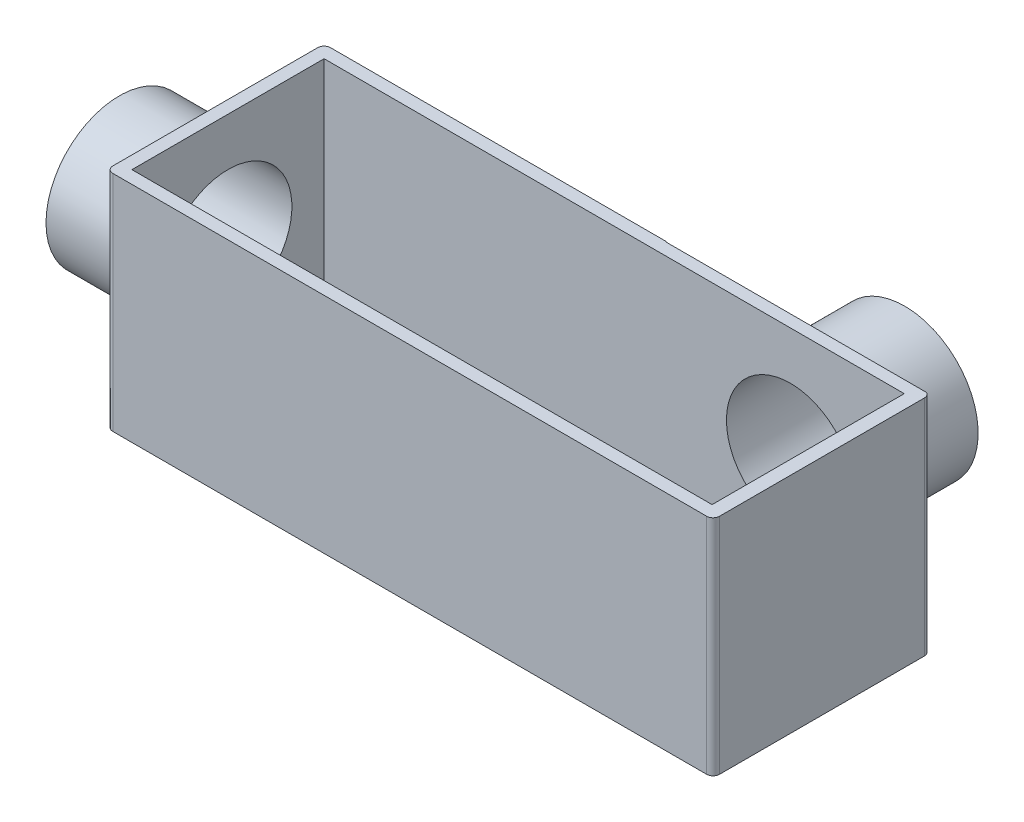
ISO-10303-21;
HEADER;
FILE_DESCRIPTION(('STEP AP214'),'2;1');
FILE_NAME('part.step','',(''),(''),'','','');
FILE_SCHEMA(('AUTOMOTIVE_DESIGN { 1 0 10303 214 1 1 1 1 }'));
ENDSEC;
DATA;
#1=APPLICATION_CONTEXT('core data for automotive mechanical design processes');
#2=APPLICATION_PROTOCOL_DEFINITION('international standard','automotive_design',2000,#1);
#3=PRODUCT_CONTEXT('',#1,'mechanical');
#4=PRODUCT('Part','Part','',(#3));
#5=PRODUCT_RELATED_PRODUCT_CATEGORY('part','',(#4));
#6=PRODUCT_DEFINITION_FORMATION('','',#4);
#7=PRODUCT_DEFINITION_CONTEXT('part definition',#1,'design');
#8=PRODUCT_DEFINITION('design','',#6,#7);
#9=PRODUCT_DEFINITION_SHAPE('','',#8);
#10=(LENGTH_UNIT() NAMED_UNIT(*) SI_UNIT(.MILLI.,.METRE.));
#11=(NAMED_UNIT(*) PLANE_ANGLE_UNIT() SI_UNIT($,.RADIAN.));
#12=(NAMED_UNIT(*) SI_UNIT($,.STERADIAN.) SOLID_ANGLE_UNIT());
#13=UNCERTAINTY_MEASURE_WITH_UNIT(LENGTH_MEASURE(1.E-05),#10,'distance_accuracy_value','');
#14=(GEOMETRIC_REPRESENTATION_CONTEXT(3) GLOBAL_UNCERTAINTY_ASSIGNED_CONTEXT((#13)) GLOBAL_UNIT_ASSIGNED_CONTEXT((#10,
#11,#12)) REPRESENTATION_CONTEXT('',''));
#15=CARTESIAN_POINT('',(0.,0.,0.));
#16=DIRECTION('',(0.,0.,1.));
#17=DIRECTION('',(1.,0.,0.));
#18=AXIS2_PLACEMENT_3D('',#15,#16,#17);
#19=CARTESIAN_POINT('',(54.,35.,-8.0909090909091));
#20=DIRECTION('',(0.,-1.,0.));
#21=DIRECTION('',(0.,0.,-1.));
#22=AXIS2_PLACEMENT_3D('',#19,#20,#21);
#23=CYLINDRICAL_SURFACE('',#22,1.);
#24=DIRECTION('',(0.,-1.,0.));
#25=VECTOR('',#24,1.);
#26=CARTESIAN_POINT('',(54.4165977904505,35.,-9.00000000000001));
#27=LINE('',#26,#25);
#28=CARTESIAN_POINT('',(54.4165977904505,35.,-9.00000000000001));
#29=VERTEX_POINT('',#28);
#30=CARTESIAN_POINT('',(54.4165977904505,0.,-9.00000000000001));
#31=VERTEX_POINT('',#30);
#32=EDGE_CURVE('E58',#29,#31,#27,.T.);
#33=ORIENTED_EDGE('',*,*,#32,.F.);
#34=CARTESIAN_POINT('',(54.,35.,-8.0909090909091));
#35=DIRECTION('',(0.,1.,0.));
#36=DIRECTION('',(0.,0.,1.));
#37=AXIS2_PLACEMENT_3D('',#34,#35,#36);
#38=CIRCLE('',#37,1.);
#39=CARTESIAN_POINT('',(55.,35.,-8.09090909090909));
#40=VERTEX_POINT('',#39);
#41=EDGE_CURVE('E213',#40,#29,#38,.T.);
#42=ORIENTED_EDGE('',*,*,#41,.F.);
#43=DIRECTION('',(0.,-1.,0.));
#44=VECTOR('',#43,1.);
#45=CARTESIAN_POINT('',(55.,35.,-8.09090909090909));
#46=LINE('',#45,#44);
#47=CARTESIAN_POINT('',(55.,0.,-8.09090909090909));
#48=VERTEX_POINT('',#47);
#49=EDGE_CURVE('E242',#40,#48,#46,.T.);
#50=ORIENTED_EDGE('',*,*,#49,.T.);
#51=CARTESIAN_POINT('',(54.,0.,-8.0909090909091));
#52=DIRECTION('',(0.,1.,0.));
#53=DIRECTION('',(0.,0.,1.));
#54=AXIS2_PLACEMENT_3D('',#51,#52,#53);
#55=CIRCLE('',#54,1.);
#56=EDGE_CURVE('E229',#48,#31,#55,.T.);
#57=ORIENTED_EDGE('',*,*,#56,.T.);
#58=EDGE_LOOP('',(#33,#42,#50,#57));
#59=FACE_BOUND('',#58,.T.);
#60=ADVANCED_FACE('F33',(#59),#23,.T.);
#61=CARTESIAN_POINT('',(-39.,35.,24.));
#62=DIRECTION('',(0.,-1.,0.));
#63=DIRECTION('',(0.,0.,-1.));
#64=AXIS2_PLACEMENT_3D('',#61,#62,#63);
#65=CYLINDRICAL_SURFACE('',#64,1.);
#66=CARTESIAN_POINT('',(-39.,0.,24.));
#67=DIRECTION('',(0.,1.,0.));
#68=DIRECTION('',(0.,0.,-1.));
#69=AXIS2_PLACEMENT_3D('',#66,#67,#68);
#70=CIRCLE('',#69,1.);
#71=CARTESIAN_POINT('',(-40.,0.,24.));
#72=VERTEX_POINT('',#71);
#73=CARTESIAN_POINT('',(-39.,0.,25.));
#74=VERTEX_POINT('',#73);
#75=EDGE_CURVE('E199',#72,#74,#70,.T.);
#76=ORIENTED_EDGE('',*,*,#75,.T.);
#77=DIRECTION('',(0.,-1.,0.));
#78=VECTOR('',#77,1.);
#79=CARTESIAN_POINT('',(-39.,35.,25.));
#80=LINE('',#79,#78);
#81=CARTESIAN_POINT('',(-39.,35.,25.));
#82=VERTEX_POINT('',#81);
#83=EDGE_CURVE('E251',#82,#74,#80,.T.);
#84=ORIENTED_EDGE('',*,*,#83,.F.);
#85=CARTESIAN_POINT('',(-39.,35.,24.));
#86=DIRECTION('',(0.,1.,0.));
#87=DIRECTION('',(0.,0.,-1.));
#88=AXIS2_PLACEMENT_3D('',#85,#86,#87);
#89=CIRCLE('',#88,1.);
#90=CARTESIAN_POINT('',(-40.,35.,24.));
#91=VERTEX_POINT('',#90);
#92=EDGE_CURVE('E204',#91,#82,#89,.T.);
#93=ORIENTED_EDGE('',*,*,#92,.F.);
#94=DIRECTION('',(0.,-1.,0.));
#95=VECTOR('',#94,1.);
#96=CARTESIAN_POINT('',(-40.,35.,24.));
#97=LINE('',#96,#95);
#98=EDGE_CURVE('E254',#91,#72,#97,.T.);
#99=ORIENTED_EDGE('',*,*,#98,.T.);
#100=EDGE_LOOP('',(#76,#84,#93,#99));
#101=FACE_BOUND('',#100,.T.);
#102=ADVANCED_FACE('F35',(#101),#65,.T.);
#103=CARTESIAN_POINT('',(54.,35.,25.));
#104=DIRECTION('',(0.,0.,-1.));
#105=DIRECTION('',(-1.,0.,0.));
#106=AXIS2_PLACEMENT_3D('',#103,#104,#105);
#107=PLANE('',#106);
#108=DIRECTION('',(1.,0.,0.));
#109=VECTOR('',#108,1.);
#110=CARTESIAN_POINT('',(54.,0.,25.));
#111=LINE('',#110,#109);
#112=CARTESIAN_POINT('',(54.,0.,25.));
#113=VERTEX_POINT('',#112);
#114=EDGE_CURVE('E223',#74,#113,#111,.T.);
#115=ORIENTED_EDGE('',*,*,#114,.T.);
#116=DIRECTION('',(0.,-1.,0.));
#117=VECTOR('',#116,1.);
#118=CARTESIAN_POINT('',(54.,35.,25.));
#119=LINE('',#118,#117);
#120=CARTESIAN_POINT('',(54.,35.,25.));
#121=VERTEX_POINT('',#120);
#122=EDGE_CURVE('E248',#121,#113,#119,.T.);
#123=ORIENTED_EDGE('',*,*,#122,.F.);
#124=DIRECTION('',(1.,0.,0.));
#125=VECTOR('',#124,1.);
#126=CARTESIAN_POINT('',(54.,35.,25.));
#127=LINE('',#126,#125);
#128=EDGE_CURVE('E207',#82,#121,#127,.T.);
#129=ORIENTED_EDGE('',*,*,#128,.F.);
#130=ORIENTED_EDGE('',*,*,#83,.T.);
#131=EDGE_LOOP('',(#115,#123,#129,#130));
#132=FACE_BOUND('',#131,.T.);
#133=ADVANCED_FACE('F297',(#132),#107,.F.);
#134=CARTESIAN_POINT('',(54.,35.,24.));
#135=DIRECTION('',(0.,-1.,0.));
#136=DIRECTION('',(0.,0.,-1.));
#137=AXIS2_PLACEMENT_3D('',#134,#135,#136);
#138=CYLINDRICAL_SURFACE('',#137,1.);
#139=CARTESIAN_POINT('',(54.,0.,24.));
#140=DIRECTION('',(0.,1.,0.));
#141=DIRECTION('',(0.,0.,1.));
#142=AXIS2_PLACEMENT_3D('',#139,#140,#141);
#143=CIRCLE('',#142,1.);
#144=CARTESIAN_POINT('',(55.,0.,24.));
#145=VERTEX_POINT('',#144);
#146=EDGE_CURVE('E225',#113,#145,#143,.T.);
#147=ORIENTED_EDGE('',*,*,#146,.T.);
#148=DIRECTION('',(0.,-1.,0.));
#149=VECTOR('',#148,1.);
#150=CARTESIAN_POINT('',(55.,35.,24.));
#151=LINE('',#150,#149);
#152=CARTESIAN_POINT('',(55.,35.,24.));
#153=VERTEX_POINT('',#152);
#154=EDGE_CURVE('E245',#153,#145,#151,.T.);
#155=ORIENTED_EDGE('',*,*,#154,.F.);
#156=CARTESIAN_POINT('',(54.,35.,24.));
#157=DIRECTION('',(0.,1.,0.));
#158=DIRECTION('',(0.,0.,1.));
#159=AXIS2_PLACEMENT_3D('',#156,#157,#158);
#160=CIRCLE('',#159,1.);
#161=EDGE_CURVE('E209',#121,#153,#160,.T.);
#162=ORIENTED_EDGE('',*,*,#161,.F.);
#163=ORIENTED_EDGE('',*,*,#122,.T.);
#164=EDGE_LOOP('',(#147,#155,#162,#163));
#165=FACE_BOUND('',#164,.T.);
#166=ADVANCED_FACE('F305',(#165),#138,.T.);
#167=CARTESIAN_POINT('',(55.,35.,24.));
#168=DIRECTION('',(-1.,0.,0.));
#169=DIRECTION('',(0.,0.,1.));
#170=AXIS2_PLACEMENT_3D('',#167,#168,#169);
#171=PLANE('',#170);
#172=DIRECTION('',(0.,0.,-1.));
#173=VECTOR('',#172,1.);
#174=CARTESIAN_POINT('',(55.,0.,24.));
#175=LINE('',#174,#173);
#176=EDGE_CURVE('E227',#145,#48,#175,.T.);
#177=ORIENTED_EDGE('',*,*,#176,.T.);
#178=ORIENTED_EDGE('',*,*,#49,.F.);
#179=DIRECTION('',(0.,0.,-1.));
#180=VECTOR('',#179,1.);
#181=CARTESIAN_POINT('',(55.,35.,24.));
#182=LINE('',#181,#180);
#183=EDGE_CURVE('E211',#153,#40,#182,.T.);
#184=ORIENTED_EDGE('',*,*,#183,.F.);
#185=ORIENTED_EDGE('',*,*,#154,.T.);
#186=EDGE_LOOP('',(#177,#178,#184,#185));
#187=FACE_BOUND('',#186,.T.);
#188=ADVANCED_FACE('F301',(#187),#171,.F.);
#189=CARTESIAN_POINT('',(-39.,35.,-9.09090909090909));
#190=DIRECTION('',(0.,0.,1.));
#191=DIRECTION('',(1.,0.,0.));
#192=AXIS2_PLACEMENT_3D('',#189,#190,#191);
#193=PLANE('',#192);
#194=DIRECTION('',(-1.,0.,0.));
#195=VECTOR('',#194,1.);
#196=CARTESIAN_POINT('',(-39.,35.,-9.09090909090909));
#197=LINE('',#196,#195);
#198=CARTESIAN_POINT('',(13.58021824893,35.,-9.0909090909091));
#199=VERTEX_POINT('',#198);
#200=CARTESIAN_POINT('',(-39.,35.,-9.09090909090909));
#201=VERTEX_POINT('',#200);
#202=EDGE_CURVE('E216',#199,#201,#197,.T.);
#203=ORIENTED_EDGE('',*,*,#202,.F.);
#204=CARTESIAN_POINT('',(35.,17.5,-9.0909090909091));
#205=DIRECTION('',(0.,0.,1.));
#206=DIRECTION('',(1.,0.,0.));
#207=AXIS2_PLACEMENT_3D('',#204,#205,#206);
#208=CIRCLE('',#207,27.6596646809659);
#209=CARTESIAN_POINT('',(13.58021824893,0.,-9.09090909090909));
#210=VERTEX_POINT('',#209);
#211=EDGE_CURVE('E189',#199,#210,#208,.T.);
#212=ORIENTED_EDGE('',*,*,#211,.T.);
#213=DIRECTION('',(-1.,0.,0.));
#214=VECTOR('',#213,1.);
#215=CARTESIAN_POINT('',(-39.,0.,-9.09090909090909));
#216=LINE('',#215,#214);
#217=CARTESIAN_POINT('',(-39.,0.,-9.09090909090909));
#218=VERTEX_POINT('',#217);
#219=EDGE_CURVE('E232',#210,#218,#216,.T.);
#220=ORIENTED_EDGE('',*,*,#219,.T.);
#221=DIRECTION('',(0.,-1.,0.));
#222=VECTOR('',#221,1.);
#223=CARTESIAN_POINT('',(-39.,35.,-9.09090909090909));
#224=LINE('',#223,#222);
#225=EDGE_CURVE('E239',#201,#218,#224,.T.);
#226=ORIENTED_EDGE('',*,*,#225,.F.);
#227=EDGE_LOOP('',(#203,#212,#220,#226));
#228=FACE_BOUND('',#227,.T.);
#229=ADVANCED_FACE('F304',(#228),#193,.F.);
#230=CARTESIAN_POINT('',(-39.,35.,-8.09090909090909));
#231=DIRECTION('',(0.,-1.,0.));
#232=DIRECTION('',(0.,0.,-1.));
#233=AXIS2_PLACEMENT_3D('',#230,#231,#232);
#234=CYLINDRICAL_SURFACE('',#233,1.);
#235=CARTESIAN_POINT('',(-39.,0.,-8.09090909090909));
#236=DIRECTION('',(0.,1.,0.));
#237=DIRECTION('',(0.,0.,1.));
#238=AXIS2_PLACEMENT_3D('',#235,#236,#237);
#239=CIRCLE('',#238,1.);
#240=CARTESIAN_POINT('',(-40.,0.,-8.09090909090908));
#241=VERTEX_POINT('',#240);
#242=EDGE_CURVE('E234',#218,#241,#239,.T.);
#243=ORIENTED_EDGE('',*,*,#242,.T.);
#244=DIRECTION('',(0.,-1.,0.));
#245=VECTOR('',#244,1.);
#246=CARTESIAN_POINT('',(-40.,35.,-8.09090909090908));
#247=LINE('',#246,#245);
#248=CARTESIAN_POINT('',(-40.,35.,-8.09090909090908));
#249=VERTEX_POINT('',#248);
#250=EDGE_CURVE('E221',#249,#241,#247,.T.);
#251=ORIENTED_EDGE('',*,*,#250,.F.);
#252=CARTESIAN_POINT('',(-39.,35.,-8.09090909090909));
#253=DIRECTION('',(0.,1.,0.));
#254=DIRECTION('',(0.,0.,1.));
#255=AXIS2_PLACEMENT_3D('',#252,#253,#254);
#256=CIRCLE('',#255,1.);
#257=EDGE_CURVE('E218',#201,#249,#256,.T.);
#258=ORIENTED_EDGE('',*,*,#257,.F.);
#259=ORIENTED_EDGE('',*,*,#225,.T.);
#260=EDGE_LOOP('',(#243,#251,#258,#259));
#261=FACE_BOUND('',#260,.T.);
#262=ADVANCED_FACE('F343',(#261),#234,.T.);
#263=CARTESIAN_POINT('',(-54.,35.,21.9545454545455));
#264=DIRECTION('',(0.,-1.,0.));
#265=DIRECTION('',(0.,0.,-1.));
#266=AXIS2_PLACEMENT_3D('',#263,#264,#265);
#267=PLANE('',#266);
#268=DIRECTION('',(1.,0.,0.));
#269=VECTOR('',#268,1.);
#270=CARTESIAN_POINT('',(52.8403353190341,35.,23.));
#271=LINE('',#270,#269);
#272=CARTESIAN_POINT('',(-38.,35.,23.));
#273=VERTEX_POINT('',#272);
#274=CARTESIAN_POINT('',(52.8403353190341,35.,23.));
#275=VERTEX_POINT('',#274);
#276=EDGE_CURVE('E167',#273,#275,#271,.T.);
#277=ORIENTED_EDGE('',*,*,#276,.F.);
#278=DIRECTION('',(0.,0.,1.));
#279=VECTOR('',#278,1.);
#280=CARTESIAN_POINT('',(-38.,35.,23.));
#281=LINE('',#280,#279);
#282=CARTESIAN_POINT('',(-38.,35.,-7.0909090909091));
#283=VERTEX_POINT('',#282);
#284=EDGE_CURVE('E50',#283,#273,#281,.T.);
#285=ORIENTED_EDGE('',*,*,#284,.F.);
#286=DIRECTION('',(-1.,0.,0.));
#287=VECTOR('',#286,1.);
#288=CARTESIAN_POINT('',(52.8403353190341,35.,-7.0909090909091));
#289=LINE('',#288,#287);
#290=CARTESIAN_POINT('',(52.8403353190341,35.,-7.0909090909091));
#291=VERTEX_POINT('',#290);
#292=EDGE_CURVE('E155',#291,#283,#289,.T.);
#293=ORIENTED_EDGE('',*,*,#292,.F.);
#294=DIRECTION('',(0.,0.,-1.));
#295=VECTOR('',#294,1.);
#296=CARTESIAN_POINT('',(52.8403353190341,35.,23.));
#297=LINE('',#296,#295);
#298=EDGE_CURVE('E158',#275,#291,#297,.T.);
#299=ORIENTED_EDGE('',*,*,#298,.F.);
#300=EDGE_LOOP('',(#277,#285,#293,#299));
#301=FACE_BOUND('',#300,.T.);
#302=DIRECTION('',(1.,0.,0.));
#303=VECTOR('',#302,1.);
#304=CARTESIAN_POINT('',(-54.,35.,-9.));
#305=LINE('',#304,#303);
#306=CARTESIAN_POINT('',(13.58021824893,35.,-9.00000000000001));
#307=VERTEX_POINT('',#306);
#308=EDGE_CURVE('E187',#307,#29,#305,.T.);
#309=ORIENTED_EDGE('',*,*,#308,.F.);
#310=DIRECTION('',(0.,0.,-1.));
#311=VECTOR('',#310,1.);
#312=CARTESIAN_POINT('',(13.58021824893,35.,-9.00000000000001));
#313=LINE('',#312,#311);
#314=EDGE_CURVE('E192',#307,#199,#313,.T.);
#315=ORIENTED_EDGE('',*,*,#314,.T.);
#316=ORIENTED_EDGE('',*,*,#202,.T.);
#317=ORIENTED_EDGE('',*,*,#257,.T.);
#318=DIRECTION('',(0.,0.,1.));
#319=VECTOR('',#318,1.);
#320=CARTESIAN_POINT('',(-40.,35.,23.9545454545455));
#321=LINE('',#320,#319);
#322=EDGE_CURVE('E202',#249,#91,#321,.T.);
#323=ORIENTED_EDGE('',*,*,#322,.T.);
#324=ORIENTED_EDGE('',*,*,#92,.T.);
#325=ORIENTED_EDGE('',*,*,#128,.T.);
#326=ORIENTED_EDGE('',*,*,#161,.T.);
#327=ORIENTED_EDGE('',*,*,#183,.T.);
#328=ORIENTED_EDGE('',*,*,#41,.T.);
#329=EDGE_LOOP('',(#309,#315,#316,#317,#323,#324,#325,#326,#327,#328));
#330=FACE_BOUND('',#329,.T.);
#331=ADVANCED_FACE('F331',(#301,#330),#267,.F.);
#332=CARTESIAN_POINT('',(-54.,0.,21.9545454545455));
#333=DIRECTION('',(0.,-1.,0.));
#334=DIRECTION('',(0.,0.,-1.));
#335=AXIS2_PLACEMENT_3D('',#332,#333,#334);
#336=PLANE('',#335);
#337=DIRECTION('',(0.,0.,-1.));
#338=VECTOR('',#337,1.);
#339=CARTESIAN_POINT('',(13.58021824893,0.,-9.00000000000001));
#340=LINE('',#339,#338);
#341=CARTESIAN_POINT('',(13.58021824893,0.,-9.00000000000001));
#342=VERTEX_POINT('',#341);
#343=EDGE_CURVE('E11',#342,#210,#340,.T.);
#344=ORIENTED_EDGE('',*,*,#343,.F.);
#345=DIRECTION('',(1.,0.,0.));
#346=VECTOR('',#345,1.);
#347=CARTESIAN_POINT('',(-54.,0.,-9.));
#348=LINE('',#347,#346);
#349=EDGE_CURVE('E42',#342,#31,#348,.T.);
#350=ORIENTED_EDGE('',*,*,#349,.T.);
#351=ORIENTED_EDGE('',*,*,#56,.F.);
#352=ORIENTED_EDGE('',*,*,#176,.F.);
#353=ORIENTED_EDGE('',*,*,#146,.F.);
#354=ORIENTED_EDGE('',*,*,#114,.F.);
#355=ORIENTED_EDGE('',*,*,#75,.F.);
#356=DIRECTION('',(0.,0.,1.));
#357=VECTOR('',#356,1.);
#358=CARTESIAN_POINT('',(-40.,0.,-8.04545454545455));
#359=LINE('',#358,#357);
#360=EDGE_CURVE('E205',#241,#72,#359,.T.);
#361=ORIENTED_EDGE('',*,*,#360,.F.);
#362=ORIENTED_EDGE('',*,*,#242,.F.);
#363=ORIENTED_EDGE('',*,*,#219,.F.);
#364=EDGE_LOOP('',(#344,#350,#351,#352,#353,#354,#355,#361,#362,#363));
#365=FACE_BOUND('',#364,.T.);
#366=ADVANCED_FACE('F324',(#365),#336,.T.);
#367=CARTESIAN_POINT('',(-40.,35.,-8.04545454545455));
#368=DIRECTION('',(1.,0.,0.));
#369=DIRECTION('',(0.,0.,-1.));
#370=AXIS2_PLACEMENT_3D('',#367,#368,#369);
#371=PLANE('',#370);
#372=ORIENTED_EDGE('',*,*,#360,.T.);
#373=ORIENTED_EDGE('',*,*,#98,.F.);
#374=ORIENTED_EDGE('',*,*,#322,.F.);
#375=ORIENTED_EDGE('',*,*,#250,.T.);
#376=EDGE_LOOP('',(#372,#373,#374,#375));
#377=FACE_BOUND('',#376,.T.);
#378=CARTESIAN_POINT('',(-40.,17.5,7.95454545454545));
#379=DIRECTION('',(-1.,0.,0.));
#380=DIRECTION('',(0.,0.,1.));
#381=AXIS2_PLACEMENT_3D('',#378,#379,#380);
#382=CIRCLE('',#381,11.5);
#383=CARTESIAN_POINT('',(-40.,17.5,19.4545454545455));
#384=VERTEX_POINT('',#383);
#385=EDGE_CURVE('E196',#384,#384,#382,.T.);
#386=ORIENTED_EDGE('',*,*,#385,.F.);
#387=EDGE_LOOP('',(#386));
#388=FACE_BOUND('',#387,.T.);
#389=ADVANCED_FACE('F338',(#377,#388),#371,.F.);
#390=CARTESIAN_POINT('',(-40.,17.5,7.95454545454545));
#391=DIRECTION('',(-1.,0.,0.));
#392=DIRECTION('',(0.,0.,1.));
#393=AXIS2_PLACEMENT_3D('',#390,#391,#392);
#394=CYLINDRICAL_SURFACE('',#393,11.5);
#395=ORIENTED_EDGE('',*,*,#385,.T.);
#396=EDGE_LOOP('',(#395));
#397=FACE_BOUND('',#396,.T.);
#398=CARTESIAN_POINT('',(-55.,17.5,7.95454545454545));
#399=DIRECTION('',(-1.,0.,0.));
#400=DIRECTION('',(0.,0.,1.));
#401=AXIS2_PLACEMENT_3D('',#398,#399,#400);
#402=CIRCLE('',#401,11.5);
#403=CARTESIAN_POINT('',(-55.,17.5,19.4545454545455));
#404=VERTEX_POINT('',#403);
#405=EDGE_CURVE('E195',#404,#404,#402,.T.);
#406=ORIENTED_EDGE('',*,*,#405,.F.);
#407=EDGE_LOOP('',(#406));
#408=FACE_BOUND('',#407,.T.);
#409=ADVANCED_FACE('F355',(#397,#408),#394,.T.);
#410=CARTESIAN_POINT('',(-55.,35.,21.9545454545454));
#411=DIRECTION('',(1.,0.,0.));
#412=DIRECTION('',(0.,0.,-1.));
#413=AXIS2_PLACEMENT_3D('',#410,#411,#412);
#414=PLANE('',#413);
#415=CARTESIAN_POINT('',(-55.,17.5,7.95454545454545));
#416=DIRECTION('',(-1.,0.,0.));
#417=DIRECTION('',(0.,0.,1.));
#418=AXIS2_PLACEMENT_3D('',#415,#416,#417);
#419=CIRCLE('',#418,10.);
#420=CARTESIAN_POINT('',(-55.,17.5,17.9545454545455));
#421=VERTEX_POINT('',#420);
#422=EDGE_CURVE('E161',#421,#421,#419,.T.);
#423=ORIENTED_EDGE('',*,*,#422,.F.);
#424=EDGE_LOOP('',(#423));
#425=FACE_BOUND('',#424,.T.);
#426=ORIENTED_EDGE('',*,*,#405,.T.);
#427=EDGE_LOOP('',(#426));
#428=FACE_BOUND('',#427,.T.);
#429=ADVANCED_FACE('F350',(#425,#428),#414,.F.);
#430=CARTESIAN_POINT('',(35.,17.5,-9.00000000000001));
#431=DIRECTION('',(0.,0.,-1.));
#432=DIRECTION('',(-1.,0.,0.));
#433=AXIS2_PLACEMENT_3D('',#430,#431,#432);
#434=CYLINDRICAL_SURFACE('',#433,27.6596646809659);
#435=CARTESIAN_POINT('',(35.,17.5,-9.00000000000001));
#436=DIRECTION('',(0.,0.,-1.));
#437=DIRECTION('',(-1.,0.,0.));
#438=AXIS2_PLACEMENT_3D('',#435,#436,#437);
#439=CIRCLE('',#438,27.6596646809659);
#440=EDGE_CURVE('E181',#342,#307,#439,.T.);
#441=ORIENTED_EDGE('',*,*,#440,.F.);
#442=ORIENTED_EDGE('',*,*,#343,.T.);
#443=ORIENTED_EDGE('',*,*,#211,.F.);
#444=ORIENTED_EDGE('',*,*,#314,.F.);
#445=EDGE_LOOP('',(#441,#442,#443,#444));
#446=FACE_BOUND('',#445,.T.);
#447=ADVANCED_FACE('F287',(#446),#434,.F.);
#448=CARTESIAN_POINT('',(35.,17.5,-9.00000000000001));
#449=DIRECTION('',(0.,0.,-1.));
#450=DIRECTION('',(-1.,0.,0.));
#451=AXIS2_PLACEMENT_3D('',#448,#449,#450);
#452=PLANE('',#451);
#453=CARTESIAN_POINT('',(35.,17.5,-9.00000000000001));
#454=DIRECTION('',(0.,0.,-1.));
#455=DIRECTION('',(-1.,0.,0.));
#456=AXIS2_PLACEMENT_3D('',#453,#454,#455);
#457=CIRCLE('',#456,11.5);
#458=CARTESIAN_POINT('',(23.5,17.5,-9.00000000000001));
#459=VERTEX_POINT('',#458);
#460=EDGE_CURVE('E178',#459,#459,#457,.T.);
#461=ORIENTED_EDGE('',*,*,#460,.F.);
#462=EDGE_LOOP('',(#461));
#463=FACE_BOUND('',#462,.T.);
#464=ORIENTED_EDGE('',*,*,#308,.T.);
#465=ORIENTED_EDGE('',*,*,#32,.T.);
#466=ORIENTED_EDGE('',*,*,#349,.F.);
#467=ORIENTED_EDGE('',*,*,#440,.T.);
#468=EDGE_LOOP('',(#464,#465,#466,#467));
#469=FACE_BOUND('',#468,.T.);
#470=ADVANCED_FACE('F281',(#463,#469),#452,.T.);
#471=CARTESIAN_POINT('',(35.,17.5,-9.00000000000001));
#472=DIRECTION('',(0.,0.,-1.));
#473=DIRECTION('',(-1.,0.,0.));
#474=AXIS2_PLACEMENT_3D('',#471,#472,#473);
#475=CYLINDRICAL_SURFACE('',#474,11.5);
#476=ORIENTED_EDGE('',*,*,#460,.T.);
#477=EDGE_LOOP('',(#476));
#478=FACE_BOUND('',#477,.T.);
#479=CARTESIAN_POINT('',(35.,17.5,-25.));
#480=DIRECTION('',(0.,0.,-1.));
#481=DIRECTION('',(-1.,0.,0.));
#482=AXIS2_PLACEMENT_3D('',#479,#480,#481);
#483=CIRCLE('',#482,11.5);
#484=CARTESIAN_POINT('',(23.5,17.5,-25.));
#485=VERTEX_POINT('',#484);
#486=EDGE_CURVE('E174',#485,#485,#483,.T.);
#487=ORIENTED_EDGE('',*,*,#486,.F.);
#488=EDGE_LOOP('',(#487));
#489=FACE_BOUND('',#488,.T.);
#490=ADVANCED_FACE('F276',(#478,#489),#475,.T.);
#491=CARTESIAN_POINT('',(21.,35.,-25.));
#492=DIRECTION('',(0.,0.,1.));
#493=DIRECTION('',(1.,0.,0.));
#494=AXIS2_PLACEMENT_3D('',#491,#492,#493);
#495=PLANE('',#494);
#496=CARTESIAN_POINT('',(35.,17.5,-25.));
#497=DIRECTION('',(0.,0.,-1.));
#498=DIRECTION('',(-1.,0.,0.));
#499=AXIS2_PLACEMENT_3D('',#496,#497,#498);
#500=CIRCLE('',#499,10.);
#501=CARTESIAN_POINT('',(25.,17.5,-25.));
#502=VERTEX_POINT('',#501);
#503=EDGE_CURVE('E264',#502,#502,#500,.T.);
#504=ORIENTED_EDGE('',*,*,#503,.F.);
#505=EDGE_LOOP('',(#504));
#506=FACE_BOUND('',#505,.T.);
#507=ORIENTED_EDGE('',*,*,#486,.T.);
#508=EDGE_LOOP('',(#507));
#509=FACE_BOUND('',#508,.T.);
#510=ADVANCED_FACE('F273',(#506,#509),#495,.F.);
#511=CARTESIAN_POINT('',(-38.,2.,23.));
#512=DIRECTION('',(-1.,0.,0.));
#513=DIRECTION('',(0.,0.,1.));
#514=AXIS2_PLACEMENT_3D('',#511,#512,#513);
#515=PLANE('',#514);
#516=CARTESIAN_POINT('',(-38.,17.5,7.95454545454545));
#517=DIRECTION('',(-1.,0.,0.));
#518=DIRECTION('',(0.,0.,1.));
#519=AXIS2_PLACEMENT_3D('',#516,#517,#518);
#520=CIRCLE('',#519,10.);
#521=CARTESIAN_POINT('',(-38.,17.5,17.9545454545454));
#522=VERTEX_POINT('',#521);
#523=EDGE_CURVE('E168',#522,#522,#520,.T.);
#524=ORIENTED_EDGE('',*,*,#523,.T.);
#525=EDGE_LOOP('',(#524));
#526=FACE_BOUND('',#525,.T.);
#527=ORIENTED_EDGE('',*,*,#284,.T.);
#528=DIRECTION('',(0.,1.,0.));
#529=VECTOR('',#528,1.);
#530=CARTESIAN_POINT('',(-38.,2.,23.));
#531=LINE('',#530,#529);
#532=CARTESIAN_POINT('',(-38.,2.,23.));
#533=VERTEX_POINT('',#532);
#534=EDGE_CURVE('E133',#533,#273,#531,.T.);
#535=ORIENTED_EDGE('',*,*,#534,.F.);
#536=DIRECTION('',(0.,0.,1.));
#537=VECTOR('',#536,1.);
#538=CARTESIAN_POINT('',(-38.,2.,23.));
#539=LINE('',#538,#537);
#540=CARTESIAN_POINT('',(-38.,2.,-7.0909090909091));
#541=VERTEX_POINT('',#540);
#542=EDGE_CURVE('E137',#541,#533,#539,.T.);
#543=ORIENTED_EDGE('',*,*,#542,.F.);
#544=DIRECTION('',(0.,1.,0.));
#545=VECTOR('',#544,1.);
#546=CARTESIAN_POINT('',(-38.,2.,-7.0909090909091));
#547=LINE('',#546,#545);
#548=EDGE_CURVE('E172',#541,#283,#547,.T.);
#549=ORIENTED_EDGE('',*,*,#548,.T.);
#550=EDGE_LOOP('',(#527,#535,#543,#549));
#551=FACE_BOUND('',#550,.T.);
#552=ADVANCED_FACE('F135',(#526,#551),#515,.F.);
#553=CARTESIAN_POINT('',(52.8403353190341,2.,-7.0909090909091));
#554=DIRECTION('',(0.,0.,-1.));
#555=DIRECTION('',(-1.,0.,0.));
#556=AXIS2_PLACEMENT_3D('',#553,#554,#555);
#557=PLANE('',#556);
#558=CARTESIAN_POINT('',(35.,17.5,-7.0909090909091));
#559=DIRECTION('',(0.,0.,-1.));
#560=DIRECTION('',(-1.,0.,0.));
#561=AXIS2_PLACEMENT_3D('',#558,#559,#560);
#562=CIRCLE('',#561,10.);
#563=CARTESIAN_POINT('',(25.,17.5,-7.0909090909091));
#564=VERTEX_POINT('',#563);
#565=EDGE_CURVE('E37',#564,#564,#562,.T.);
#566=ORIENTED_EDGE('',*,*,#565,.T.);
#567=EDGE_LOOP('',(#566));
#568=FACE_BOUND('',#567,.T.);
#569=ORIENTED_EDGE('',*,*,#292,.T.);
#570=ORIENTED_EDGE('',*,*,#548,.F.);
#571=DIRECTION('',(-1.,0.,0.));
#572=VECTOR('',#571,1.);
#573=CARTESIAN_POINT('',(52.8403353190341,2.,-7.0909090909091));
#574=LINE('',#573,#572);
#575=CARTESIAN_POINT('',(52.8403353190341,2.,-7.0909090909091));
#576=VERTEX_POINT('',#575);
#577=EDGE_CURVE('E143',#576,#541,#574,.T.);
#578=ORIENTED_EDGE('',*,*,#577,.F.);
#579=DIRECTION('',(0.,1.,0.));
#580=VECTOR('',#579,1.);
#581=CARTESIAN_POINT('',(52.8403353190341,2.,-7.0909090909091));
#582=LINE('',#581,#580);
#583=EDGE_CURVE('E175',#576,#291,#582,.T.);
#584=ORIENTED_EDGE('',*,*,#583,.T.);
#585=EDGE_LOOP('',(#569,#570,#578,#584));
#586=FACE_BOUND('',#585,.T.);
#587=ADVANCED_FACE('F415',(#568,#586),#557,.F.);
#588=CARTESIAN_POINT('',(52.8403353190341,2.,23.));
#589=DIRECTION('',(1.,0.,0.));
#590=DIRECTION('',(0.,0.,-1.));
#591=AXIS2_PLACEMENT_3D('',#588,#589,#590);
#592=PLANE('',#591);
#593=ORIENTED_EDGE('',*,*,#298,.T.);
#594=ORIENTED_EDGE('',*,*,#583,.F.);
#595=DIRECTION('',(0.,0.,-1.));
#596=VECTOR('',#595,1.);
#597=CARTESIAN_POINT('',(52.8403353190341,2.,23.));
#598=LINE('',#597,#596);
#599=CARTESIAN_POINT('',(52.8403353190341,2.,23.));
#600=VERTEX_POINT('',#599);
#601=EDGE_CURVE('E151',#600,#576,#598,.T.);
#602=ORIENTED_EDGE('',*,*,#601,.F.);
#603=DIRECTION('',(0.,1.,0.));
#604=VECTOR('',#603,1.);
#605=CARTESIAN_POINT('',(52.8403353190341,2.,23.));
#606=LINE('',#605,#604);
#607=EDGE_CURVE('E142',#600,#275,#606,.T.);
#608=ORIENTED_EDGE('',*,*,#607,.T.);
#609=EDGE_LOOP('',(#593,#594,#602,#608));
#610=FACE_BOUND('',#609,.T.);
#611=ADVANCED_FACE('F442',(#610),#592,.F.);
#612=CARTESIAN_POINT('',(52.8403353190341,2.,23.));
#613=DIRECTION('',(0.,0.,1.));
#614=DIRECTION('',(1.,0.,0.));
#615=AXIS2_PLACEMENT_3D('',#612,#613,#614);
#616=PLANE('',#615);
#617=ORIENTED_EDGE('',*,*,#276,.T.);
#618=ORIENTED_EDGE('',*,*,#607,.F.);
#619=DIRECTION('',(1.,0.,0.));
#620=VECTOR('',#619,1.);
#621=CARTESIAN_POINT('',(52.8403353190341,2.,23.));
#622=LINE('',#621,#620);
#623=EDGE_CURVE('E146',#533,#600,#622,.T.);
#624=ORIENTED_EDGE('',*,*,#623,.F.);
#625=ORIENTED_EDGE('',*,*,#534,.T.);
#626=EDGE_LOOP('',(#617,#618,#624,#625));
#627=FACE_BOUND('',#626,.T.);
#628=ADVANCED_FACE('F147',(#627),#616,.F.);
#629=CARTESIAN_POINT('',(0.,2.,0.));
#630=DIRECTION('',(0.,1.,0.));
#631=DIRECTION('',(0.,0.,1.));
#632=AXIS2_PLACEMENT_3D('',#629,#630,#631);
#633=PLANE('',#632);
#634=ORIENTED_EDGE('',*,*,#542,.T.);
#635=ORIENTED_EDGE('',*,*,#623,.T.);
#636=ORIENTED_EDGE('',*,*,#601,.T.);
#637=ORIENTED_EDGE('',*,*,#577,.T.);
#638=EDGE_LOOP('',(#634,#635,#636,#637));
#639=FACE_BOUND('',#638,.T.);
#640=ADVANCED_FACE('F153',(#639),#633,.T.);
#641=CARTESIAN_POINT('',(-22.,17.5,7.95454545454545));
#642=DIRECTION('',(-1.,0.,0.));
#643=DIRECTION('',(0.,0.,1.));
#644=AXIS2_PLACEMENT_3D('',#641,#642,#643);
#645=CYLINDRICAL_SURFACE('',#644,10.);
#646=ORIENTED_EDGE('',*,*,#422,.T.);
#647=EDGE_LOOP('',(#646));
#648=FACE_BOUND('',#647,.T.);
#649=ORIENTED_EDGE('',*,*,#523,.F.);
#650=EDGE_LOOP('',(#649));
#651=FACE_BOUND('',#650,.T.);
#652=ADVANCED_FACE('F422',(#648,#651),#645,.F.);
#653=CARTESIAN_POINT('',(35.,17.5,7.99999999999999));
#654=DIRECTION('',(0.,0.,-1.));
#655=DIRECTION('',(-1.,0.,0.));
#656=AXIS2_PLACEMENT_3D('',#653,#654,#655);
#657=CYLINDRICAL_SURFACE('',#656,10.);
#658=ORIENTED_EDGE('',*,*,#503,.T.);
#659=EDGE_LOOP('',(#658));
#660=FACE_BOUND('',#659,.T.);
#661=ORIENTED_EDGE('',*,*,#565,.F.);
#662=EDGE_LOOP('',(#661));
#663=FACE_BOUND('',#662,.T.);
#664=ADVANCED_FACE('F270',(#660,#663),#657,.F.);
#665=CLOSED_SHELL('',(#60,#102,#133,#166,#188,#229,#262,#331,#366,#389,#409,#429,#447,#470,#490,
#510,#552,#587,#611,#628,#640,#652,#664));
#666=MANIFOLD_SOLID_BREP('B2',#665);
#667=ADVANCED_BREP_SHAPE_REPRESENTATION('',(#18,#666),#14);
#668=SHAPE_DEFINITION_REPRESENTATION(#9,#667);
ENDSEC;
END-ISO-10303-21;
